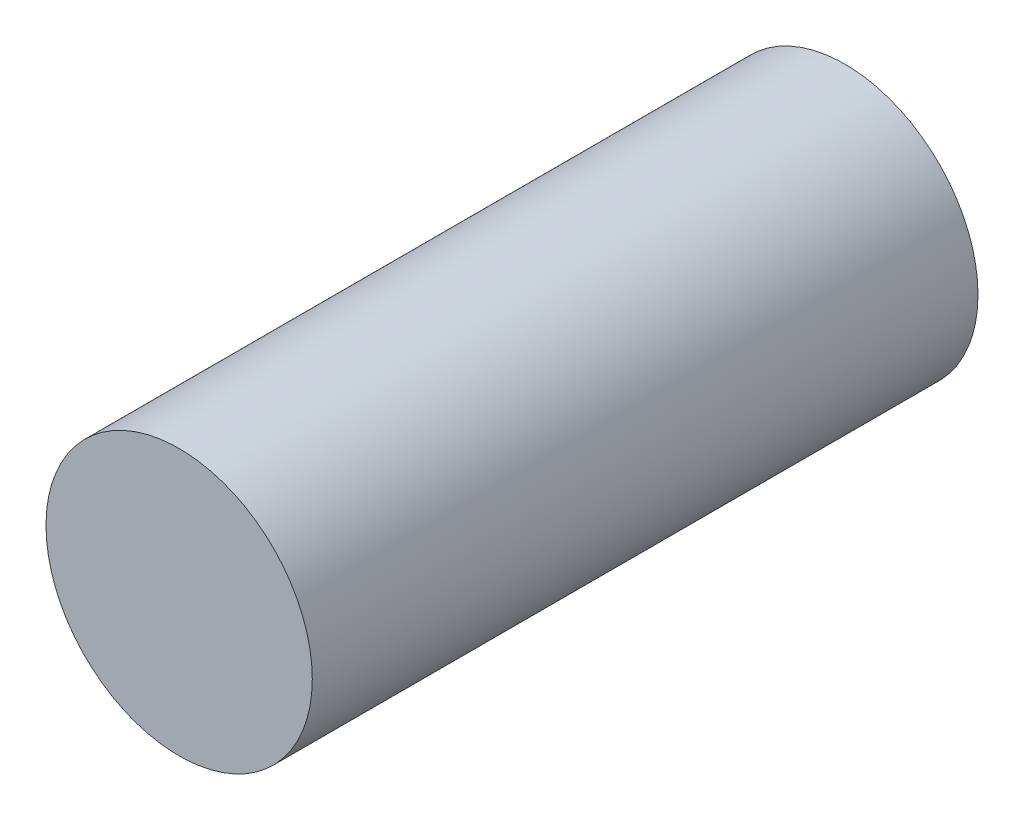
ISO-10303-21;
HEADER;
FILE_DESCRIPTION(('STEP AP214'),'2;1');
FILE_NAME('part.step','',(''),(''),'','','');
FILE_SCHEMA(('AUTOMOTIVE_DESIGN { 1 0 10303 214 1 1 1 1 }'));
ENDSEC;
DATA;
#1=APPLICATION_CONTEXT('core data for automotive mechanical design processes');
#2=APPLICATION_PROTOCOL_DEFINITION('international standard','automotive_design',2000,#1);
#3=PRODUCT_CONTEXT('',#1,'mechanical');
#4=PRODUCT('Part','Part','',(#3));
#5=PRODUCT_RELATED_PRODUCT_CATEGORY('part','',(#4));
#6=PRODUCT_DEFINITION_FORMATION('','',#4);
#7=PRODUCT_DEFINITION_CONTEXT('part definition',#1,'design');
#8=PRODUCT_DEFINITION('design','',#6,#7);
#9=PRODUCT_DEFINITION_SHAPE('','',#8);
#10=(LENGTH_UNIT() NAMED_UNIT(*) SI_UNIT(.MILLI.,.METRE.));
#11=(NAMED_UNIT(*) PLANE_ANGLE_UNIT() SI_UNIT($,.RADIAN.));
#12=(NAMED_UNIT(*) SI_UNIT($,.STERADIAN.) SOLID_ANGLE_UNIT());
#13=UNCERTAINTY_MEASURE_WITH_UNIT(LENGTH_MEASURE(1.E-05),#10,'distance_accuracy_value','');
#14=(GEOMETRIC_REPRESENTATION_CONTEXT(3) GLOBAL_UNCERTAINTY_ASSIGNED_CONTEXT((#13)) GLOBAL_UNIT_ASSIGNED_CONTEXT((#10,
#11,#12)) REPRESENTATION_CONTEXT('',''));
#15=CARTESIAN_POINT('',(0.,0.,0.));
#16=DIRECTION('',(0.,0.,1.));
#17=DIRECTION('',(1.,0.,0.));
#18=AXIS2_PLACEMENT_3D('',#15,#16,#17);
#19=CARTESIAN_POINT('',(0.80000094,0.,3.99999962));
#20=DIRECTION('',(0.,0.,-1.));
#21=DIRECTION('',(0.,-1.,0.));
#22=AXIS2_PLACEMENT_3D('',#19,#20,#21);
#23=PLANE('',#22);
#24=CARTESIAN_POINT('',(0.,0.,3.99999962));
#25=DIRECTION('',(0.,0.,1.));
#26=DIRECTION('',(1.,0.,0.));
#27=AXIS2_PLACEMENT_3D('',#24,#25,#26);
#28=CIRCLE('',#27,0.80000094);
#29=CARTESIAN_POINT('',(-0.80000094,0.,3.99999962));
#30=VERTEX_POINT('',#29);
#31=EDGE_CURVE('E11',#30,#30,#28,.T.);
#32=ORIENTED_EDGE('',*,*,#31,.T.);
#33=EDGE_LOOP('',(#32));
#34=FACE_BOUND('',#33,.T.);
#35=ADVANCED_FACE('F17',(#34),#23,.F.);
#36=CARTESIAN_POINT('',(0.80000094,0.,0.));
#37=DIRECTION('',(0.,0.,-1.));
#38=DIRECTION('',(0.,-1.,0.));
#39=AXIS2_PLACEMENT_3D('',#36,#37,#38);
#40=PLANE('',#39);
#41=CARTESIAN_POINT('',(0.,0.,0.));
#42=DIRECTION('',(0.,0.,1.));
#43=DIRECTION('',(1.,0.,0.));
#44=AXIS2_PLACEMENT_3D('',#41,#42,#43);
#45=CIRCLE('',#44,0.80000094);
#46=CARTESIAN_POINT('',(-0.80000094,0.,0.));
#47=VERTEX_POINT('',#46);
#48=EDGE_CURVE('E43',#47,#47,#45,.T.);
#49=ORIENTED_EDGE('',*,*,#48,.F.);
#50=EDGE_LOOP('',(#49));
#51=FACE_BOUND('',#50,.T.);
#52=ADVANCED_FACE('F19',(#51),#40,.T.);
#53=CARTESIAN_POINT('',(0.,0.,0.));
#54=DIRECTION('',(0.,0.,-1.));
#55=DIRECTION('',(1.,0.,0.));
#56=AXIS2_PLACEMENT_3D('',#53,#54,#55);
#57=CYLINDRICAL_SURFACE('',#56,0.80000094);
#58=ORIENTED_EDGE('',*,*,#48,.T.);
#59=DIRECTION('',(0.,0.,1.));
#60=VECTOR('',#59,1.);
#61=CARTESIAN_POINT('',(-0.80000094,0.,0.));
#62=LINE('',#61,#60);
#63=EDGE_CURVE('E27',#47,#30,#62,.T.);
#64=ORIENTED_EDGE('',*,*,#63,.T.);
#65=ORIENTED_EDGE('',*,*,#31,.F.);
#66=ORIENTED_EDGE('',*,*,#63,.F.);
#67=EDGE_LOOP('',(#58,#64,#65,#66));
#68=FACE_BOUND('',#67,.T.);
#69=ADVANCED_FACE('F41',(#68),#57,.T.);
#70=CLOSED_SHELL('',(#35,#52,#69));
#71=MANIFOLD_SOLID_BREP('B1',#70);
#72=ADVANCED_BREP_SHAPE_REPRESENTATION('',(#18,#71),#14);
#73=SHAPE_DEFINITION_REPRESENTATION(#9,#72);
ENDSEC;
END-ISO-10303-21;
